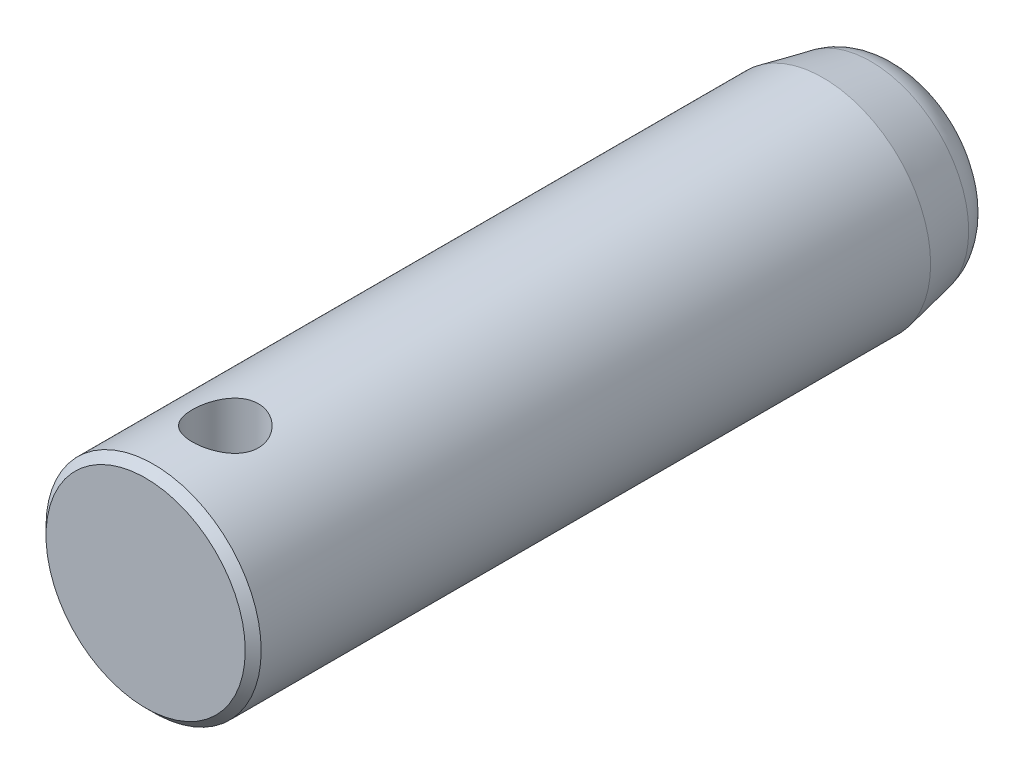
ISO-10303-21;
HEADER;
FILE_DESCRIPTION(('STEP AP214'),'2;1');
FILE_NAME('part.step','',(''),(''),'','','');
FILE_SCHEMA(('AUTOMOTIVE_DESIGN { 1 0 10303 214 1 1 1 1 }'));
ENDSEC;
DATA;
#1=APPLICATION_CONTEXT('core data for automotive mechanical design processes');
#2=APPLICATION_PROTOCOL_DEFINITION('international standard','automotive_design',2000,#1);
#3=PRODUCT_CONTEXT('',#1,'mechanical');
#4=PRODUCT('Part','Part','',(#3));
#5=PRODUCT_RELATED_PRODUCT_CATEGORY('part','',(#4));
#6=PRODUCT_DEFINITION_FORMATION('','',#4);
#7=PRODUCT_DEFINITION_CONTEXT('part definition',#1,'design');
#8=PRODUCT_DEFINITION('design','',#6,#7);
#9=PRODUCT_DEFINITION_SHAPE('','',#8);
#10=(LENGTH_UNIT() NAMED_UNIT(*) SI_UNIT(.MILLI.,.METRE.));
#11=(NAMED_UNIT(*) PLANE_ANGLE_UNIT() SI_UNIT($,.RADIAN.));
#12=(NAMED_UNIT(*) SI_UNIT($,.STERADIAN.) SOLID_ANGLE_UNIT());
#13=UNCERTAINTY_MEASURE_WITH_UNIT(LENGTH_MEASURE(1.E-05),#10,'distance_accuracy_value','');
#14=(GEOMETRIC_REPRESENTATION_CONTEXT(3) GLOBAL_UNCERTAINTY_ASSIGNED_CONTEXT((#13)) GLOBAL_UNIT_ASSIGNED_CONTEXT((#10,
#11,#12)) REPRESENTATION_CONTEXT('',''));
#15=CARTESIAN_POINT('',(0.,0.,0.));
#16=DIRECTION('',(0.,0.,1.));
#17=DIRECTION('',(1.,0.,0.));
#18=AXIS2_PLACEMENT_3D('',#15,#16,#17);
#19=CARTESIAN_POINT('',(0.,0.,-95.));
#20=DIRECTION('',(0.,0.,1.));
#21=DIRECTION('',(1.,0.,0.));
#22=AXIS2_PLACEMENT_3D('',#19,#20,#21);
#23=PLANE('',#22);
#24=CARTESIAN_POINT('',(0.,0.,-95.));
#25=DIRECTION('',(0.,0.,1.));
#26=DIRECTION('',(1.,0.,0.));
#27=AXIS2_PLACEMENT_3D('',#24,#25,#26);
#28=CIRCLE('',#27,7.38030565633467);
#29=CARTESIAN_POINT('',(7.38030565633467,0.,-95.));
#30=VERTEX_POINT('',#29);
#31=EDGE_CURVE('E10',#30,#30,#28,.T.);
#32=ORIENTED_EDGE('',*,*,#31,.F.);
#33=EDGE_LOOP('',(#32));
#34=FACE_BOUND('',#33,.T.);
#35=ADVANCED_FACE('F32',(#34),#23,.F.);
#36=CARTESIAN_POINT('',(0.,0.,-90.));
#37=DIRECTION('',(0.,0.,1.));
#38=DIRECTION('',(1.,0.,0.));
#39=AXIS2_PLACEMENT_3D('',#36,#37,#38);
#40=TOROIDAL_SURFACE('',#39,7.3803056563347,5.);
#41=CARTESIAN_POINT('',(0.,0.,-90.996839672086));
#42=DIRECTION('',(0.,0.,1.));
#43=DIRECTION('',(1.,0.,0.));
#44=AXIS2_PLACEMENT_3D('',#41,#42,#43);
#45=CIRCLE('',#44,12.2799291794389);
#46=CARTESIAN_POINT('',(12.2799291794389,0.,-90.996839672086));
#47=VERTEX_POINT('',#46);
#48=EDGE_CURVE('E38',#47,#47,#45,.T.);
#49=ORIENTED_EDGE('',*,*,#48,.F.);
#50=EDGE_LOOP('',(#49));
#51=FACE_BOUND('',#50,.T.);
#52=ORIENTED_EDGE('',*,*,#31,.T.);
#53=EDGE_LOOP('',(#52));
#54=FACE_BOUND('',#53,.T.);
#55=ADVANCED_FACE('F86',(#51,#54),#40,.T.);
#56=CARTESIAN_POINT('',(0.,0.,-90.996839672086));
#57=DIRECTION('',(0.,0.,1.));
#58=DIRECTION('',(1.,0.,0.));
#59=AXIS2_PLACEMENT_3D('',#56,#57,#58);
#60=CONICAL_SURFACE('',#59,12.2799291794389,0.200712863979348);
#61=CARTESIAN_POINT('',(0.,0.,-85.));
#62=DIRECTION('',(0.,0.,1.));
#63=DIRECTION('',(1.,0.,0.));
#64=AXIS2_PLACEMENT_3D('',#61,#62,#63);
#65=CIRCLE('',#64,13.5);
#66=CARTESIAN_POINT('',(13.5,0.,-85.));
#67=VERTEX_POINT('',#66);
#68=EDGE_CURVE('E42',#67,#67,#65,.T.);
#69=ORIENTED_EDGE('',*,*,#68,.F.);
#70=EDGE_LOOP('',(#69));
#71=FACE_BOUND('',#70,.T.);
#72=ORIENTED_EDGE('',*,*,#48,.T.);
#73=EDGE_LOOP('',(#72));
#74=FACE_BOUND('',#73,.T.);
#75=ADVANCED_FACE('F83',(#71,#74),#60,.T.);
#76=CARTESIAN_POINT('',(0.,0.,0.));
#77=DIRECTION('',(0.,0.,1.));
#78=DIRECTION('',(1.,0.,0.));
#79=AXIS2_PLACEMENT_3D('',#76,#77,#78);
#80=CYLINDRICAL_SURFACE('',#79,13.5);
#81=CARTESIAN_POINT('',(0.,-13.5,-5.85));
#82=CARTESIAN_POINT('',(-0.227402156007267,-13.4999985114752,-5.85000202340181));
#83=CARTESIAN_POINT('',(-0.454824968339302,-13.4941997302581,-5.86875273926511));
#84=CARTESIAN_POINT('',(-0.903031316792985,-13.4716346966968,-5.94307125364936));
#85=CARTESIAN_POINT('',(-1.12381313931206,-13.4548656386125,-5.99864847090315));
#86=CARTESIAN_POINT('',(-1.55220891966356,-13.4121942288627,-6.14457699874578));
#87=CARTESIAN_POINT('',(-1.75984231361689,-13.3863057478862,-6.23487551705309));
#88=CARTESIAN_POINT('',(-2.15702093556029,-13.3280758153734,-6.44746213115252));
#89=CARTESIAN_POINT('',(-2.34656348766923,-13.2957334113942,-6.56975494935885));
#90=CARTESIAN_POINT('',(-2.70786538277092,-13.2269507421959,-6.84672125546268));
#91=CARTESIAN_POINT('',(-2.87900580260451,-13.1904233620054,-7.00218042183089));
#92=CARTESIAN_POINT('',(-3.19324322225717,-13.1178983594875,-7.33939296074517));
#93=CARTESIAN_POINT('',(-3.33633521178908,-13.0819008328682,-7.52115102099837));
#94=CARTESIAN_POINT('',(-3.59372900090108,-13.0135819629174,-7.91111002046801));
#95=CARTESIAN_POINT('',(-3.70726493005124,-12.9813684442808,-8.11983715068284));
#96=CARTESIAN_POINT('',(-3.89736840380634,-12.9255717824294,-8.55457239406956));
#97=CARTESIAN_POINT('',(-3.97394533010134,-12.9019864494003,-8.78057610485526));
#98=CARTESIAN_POINT('',(-4.08570588385705,-12.867026401145,-9.23647883648235));
#99=CARTESIAN_POINT('',(-4.12203473020294,-12.8553147095788,-9.46607056790324));
#100=CARTESIAN_POINT('',(-4.15584500674148,-12.8444266713359,-9.92836599565646));
#101=CARTESIAN_POINT('',(-4.15333638394895,-12.8452471149403,-10.1610688799085));
#102=CARTESIAN_POINT('',(-4.11044021260336,-12.8590327013092,-10.6135742797313));
#103=CARTESIAN_POINT('',(-4.07149974371518,-12.8715338595716,-10.8335304736431));
#104=CARTESIAN_POINT('',(-3.95918810327311,-12.9065198430853,-11.263623003534));
#105=CARTESIAN_POINT('',(-3.88581338030964,-12.9290056981048,-11.4737583241693));
#106=CARTESIAN_POINT('',(-3.70567612723075,-12.9817891067039,-11.8817293241424));
#107=CARTESIAN_POINT('',(-3.5984530779988,-13.0121933290453,-12.0793472718526));
#108=CARTESIAN_POINT('',(-3.35398276504338,-13.0773378249785,-12.4542645180682));
#109=CARTESIAN_POINT('',(-3.21672791543712,-13.1120791931579,-12.6315586656091));
#110=CARTESIAN_POINT('',(-2.90895386576823,-13.1838532734004,-12.968987565674));
#111=CARTESIAN_POINT('',(-2.73723745155003,-13.2209195702755,-13.1280251328282));
#112=CARTESIAN_POINT('',(-2.36911014946948,-13.2918172589167,-13.4153084348377));
#113=CARTESIAN_POINT('',(-2.17269754978059,-13.3256484261519,-13.5435520334012));
#114=CARTESIAN_POINT('',(-1.75868848152416,-13.3865998005739,-13.7663184515394));
#115=CARTESIAN_POINT('',(-1.54094724254517,-13.4136689807238,-13.8605871185585));
#116=CARTESIAN_POINT('',(-1.09167347800343,-13.457678365562,-14.0108363972219));
#117=CARTESIAN_POINT('',(-0.860145021006423,-13.4746215422742,-14.066828243966));
#118=CARTESIAN_POINT('',(-0.399188106412075,-13.4959950029713,-14.1370829400978));
#119=CARTESIAN_POINT('',(-0.170006448803978,-13.5008706668949,-14.1528317975624));
#120=CARTESIAN_POINT('',(0.287745416691617,-13.498872619694,-14.1463330724631));
#121=CARTESIAN_POINT('',(0.516315706166909,-13.4920005636251,-14.1240908422031));
#122=CARTESIAN_POINT('',(0.960675494497208,-13.4675714515657,-14.043437895994));
#123=CARTESIAN_POINT('',(1.17663991931202,-13.4502738512498,-13.9859048486332));
#124=CARTESIAN_POINT('',(1.59579566926548,-13.4070082324494,-13.8373681819906));
#125=CARTESIAN_POINT('',(1.79898542949823,-13.381039154152,-13.7463604713559));
#126=CARTESIAN_POINT('',(2.19221812267537,-13.3223373717104,-13.5310238449964));
#127=CARTESIAN_POINT('',(2.38183124869987,-13.2894579633788,-13.4059511280695));
#128=CARTESIAN_POINT('',(2.73787962413219,-13.220701610105,-13.1269318949357));
#129=CARTESIAN_POINT('',(2.90430876171323,-13.1848238787098,-12.9729777899448));
#130=CARTESIAN_POINT('',(3.21587033057996,-13.1123897918169,-12.6335792260664));
#131=CARTESIAN_POINT('',(3.35994433065731,-13.075859990711,-12.4471553110202));
#132=CARTESIAN_POINT('',(3.61485020488153,-13.0077026722783,-12.0519825161036));
#133=CARTESIAN_POINT('',(3.7256827585564,-12.9760750547466,-11.8432340927135));
#134=CARTESIAN_POINT('',(3.91023966396336,-12.9216601439022,-11.4098705696321));
#135=CARTESIAN_POINT('',(3.98412058305053,-12.8988356468056,-11.1853270931831));
#136=CARTESIAN_POINT('',(4.09277666601773,-12.8647768867868,-10.7261463855507));
#137=CARTESIAN_POINT('',(4.127566093726,-12.853538396449,-10.4915128685211));
#138=CARTESIAN_POINT('',(4.15604952644762,-12.8443547896536,-10.0298484534816));
#139=CARTESIAN_POINT('',(4.15147530687562,-12.8458494569784,-9.80293419356281));
#140=CARTESIAN_POINT('',(4.10552258575548,-12.8606085993591,-9.35327329552538));
#141=CARTESIAN_POINT('',(4.06414569867098,-12.8738725581183,-9.13052647502666));
#142=CARTESIAN_POINT('',(3.94690468087593,-12.9102906828205,-8.69851045070577));
#143=CARTESIAN_POINT('',(3.87152084296221,-12.9333068485791,-8.48909840021823));
#144=CARTESIAN_POINT('',(3.6887820730902,-12.9866047993612,-8.0857271769166));
#145=CARTESIAN_POINT('',(3.58142079187376,-13.0168880270587,-7.89177108265202));
#146=CARTESIAN_POINT('',(3.33299815357153,-13.0827447309675,-7.51683686550757));
#147=CARTESIAN_POINT('',(3.19081067615643,-13.1184755716584,-7.33663257207719));
#148=CARTESIAN_POINT('',(2.87877202274273,-13.1904614239745,-7.00208083647706));
#149=CARTESIAN_POINT('',(2.7089135407234,-13.2267165717234,-6.84774024503557));
#150=CARTESIAN_POINT('',(2.3399697344458,-13.2970238815157,-6.56448108276189));
#151=CARTESIAN_POINT('',(2.14013736722609,-13.3309718952768,-6.43650688508655));
#152=CARTESIAN_POINT('',(1.72075073501906,-13.3915568619035,-6.21614372184271));
#153=CARTESIAN_POINT('',(1.50120488448952,-13.4181969145775,-6.1237396618073));
#154=CARTESIAN_POINT('',(1.06991188305481,-13.4591133603792,-5.9845018162803));
#155=CARTESIAN_POINT('',(0.859366298679378,-13.4743153877928,-5.93420534725839));
#156=CARTESIAN_POINT('',(0.432552652041234,-13.4947584828185,-5.86695659896587));
#157=CARTESIAN_POINT('',(0.21628566908605,-13.5000014157587,-5.84999807551158));
#158=CARTESIAN_POINT('',(0.,-13.5,-5.85));
#159=B_SPLINE_CURVE_WITH_KNOTS('',3,(#81,#82,#83,#84,#85,#86,#87,#88,#89,#90,#91,#92,#93,#94,
#95,#96,#97,#98,#99,#100,#101,#102,#103,#104,#105,#106,#107,#108,#109,#110,#111,#112,#113,#114,
#115,#116,#117,#118,#119,#120,#121,#122,#123,#124,#125,#126,#127,#128,#129,#130,#131,#132,#133,
#134,#135,#136,#137,#138,#139,#140,#141,#142,#143,#144,#145,#146,#147,#148,#149,#150,#151,#152,
#153,#154,#155,#156,#157,#158),.UNSPECIFIED.,.T.,.F.,(4,2,2,2,2,2,2,2,2,2,2,2,2,2,2,2,2,2,2,2,2,
2,2,2,2,2,2,2,2,2,2,2,2,2,2,2,2,2,4),(0.,0.68141169044088,1.36299772579499,2.04355151003841,
2.72420580193038,3.42325233322634,4.1224236215387,4.83822754434267,5.55384967146526,
6.24854021504378,6.94305283810006,7.61109995028716,8.2792159772963,8.95684502644675,
9.63464543931846,10.3422469398867,11.0498975152189,11.7627369355173,12.4753670316182,
13.1612752230664,13.8470867895824,14.5164975718987,15.1859901983922,15.871470040127,
16.5571302493392,17.2690237307241,17.9809026584545,18.6897391832454,19.3983169814273,
20.0758863108633,20.7534259180761,21.4216822525062,22.0900713606422,22.7838735745449,
23.4778592719708,24.1935164223663,24.9088695423617,25.5570920478896,26.2051931300331),.UNSPECIFIED.);
#160=CARTESIAN_POINT('',(0.,-13.5,-5.85));
#161=VERTEX_POINT('',#160);
#162=EDGE_CURVE('E54',#161,#161,#159,.T.);
#163=ORIENTED_EDGE('',*,*,#162,.F.);
#164=EDGE_LOOP('',(#163));
#165=FACE_BOUND('',#164,.T.);
#166=CARTESIAN_POINT('',(0.,13.5,-5.85));
#167=CARTESIAN_POINT('',(0.227402156007267,13.4999985114752,-5.85000202340181));
#168=CARTESIAN_POINT('',(0.454824968339302,13.4941997302581,-5.86875273926511));
#169=CARTESIAN_POINT('',(0.903031316792985,13.4716346966968,-5.94307125364936));
#170=CARTESIAN_POINT('',(1.12381313931206,13.4548656386125,-5.99864847090315));
#171=CARTESIAN_POINT('',(1.55220891966356,13.4121942288627,-6.14457699874578));
#172=CARTESIAN_POINT('',(1.75984231361689,13.3863057478862,-6.23487551705309));
#173=CARTESIAN_POINT('',(2.15702093556029,13.3280758153734,-6.44746213115252));
#174=CARTESIAN_POINT('',(2.34656348766923,13.2957334113942,-6.56975494935885));
#175=CARTESIAN_POINT('',(2.70786538277092,13.2269507421959,-6.84672125546268));
#176=CARTESIAN_POINT('',(2.87900580260451,13.1904233620054,-7.00218042183089));
#177=CARTESIAN_POINT('',(3.19324322225717,13.1178983594875,-7.33939296074517));
#178=CARTESIAN_POINT('',(3.33633521178908,13.0819008328682,-7.52115102099837));
#179=CARTESIAN_POINT('',(3.59372900090108,13.0135819629174,-7.91111002046801));
#180=CARTESIAN_POINT('',(3.70726493005124,12.9813684442808,-8.11983715068284));
#181=CARTESIAN_POINT('',(3.89736840380634,12.9255717824294,-8.55457239406956));
#182=CARTESIAN_POINT('',(3.97394533010134,12.9019864494003,-8.78057610485526));
#183=CARTESIAN_POINT('',(4.08570588385705,12.867026401145,-9.23647883648235));
#184=CARTESIAN_POINT('',(4.12203473020294,12.8553147095788,-9.46607056790324));
#185=CARTESIAN_POINT('',(4.15584500674148,12.8444266713359,-9.92836599565646));
#186=CARTESIAN_POINT('',(4.15333638394895,12.8452471149403,-10.1610688799085));
#187=CARTESIAN_POINT('',(4.11044021260336,12.8590327013092,-10.6135742797313));
#188=CARTESIAN_POINT('',(4.07149974371518,12.8715338595716,-10.8335304736431));
#189=CARTESIAN_POINT('',(3.95918810327311,12.9065198430853,-11.263623003534));
#190=CARTESIAN_POINT('',(3.88581338030964,12.9290056981048,-11.4737583241693));
#191=CARTESIAN_POINT('',(3.70567612723075,12.9817891067039,-11.8817293241424));
#192=CARTESIAN_POINT('',(3.5984530779988,13.0121933290453,-12.0793472718526));
#193=CARTESIAN_POINT('',(3.35398276504338,13.0773378249785,-12.4542645180682));
#194=CARTESIAN_POINT('',(3.21672791543712,13.1120791931579,-12.6315586656091));
#195=CARTESIAN_POINT('',(2.90895386576823,13.1838532734004,-12.968987565674));
#196=CARTESIAN_POINT('',(2.73723745155003,13.2209195702755,-13.1280251328282));
#197=CARTESIAN_POINT('',(2.36911014946948,13.2918172589167,-13.4153084348377));
#198=CARTESIAN_POINT('',(2.17269754978059,13.3256484261519,-13.5435520334012));
#199=CARTESIAN_POINT('',(1.75868848152416,13.3865998005739,-13.7663184515394));
#200=CARTESIAN_POINT('',(1.54094724254517,13.4136689807238,-13.8605871185585));
#201=CARTESIAN_POINT('',(1.09167347800343,13.457678365562,-14.0108363972219));
#202=CARTESIAN_POINT('',(0.860145021006423,13.4746215422742,-14.066828243966));
#203=CARTESIAN_POINT('',(0.399188106412075,13.4959950029713,-14.1370829400978));
#204=CARTESIAN_POINT('',(0.170006448803978,13.5008706668949,-14.1528317975624));
#205=CARTESIAN_POINT('',(-0.287745416691617,13.498872619694,-14.1463330724631));
#206=CARTESIAN_POINT('',(-0.516315706166909,13.4920005636251,-14.1240908422031));
#207=CARTESIAN_POINT('',(-0.960675494497208,13.4675714515657,-14.043437895994));
#208=CARTESIAN_POINT('',(-1.17663991931202,13.4502738512498,-13.9859048486332));
#209=CARTESIAN_POINT('',(-1.59579566926548,13.4070082324494,-13.8373681819906));
#210=CARTESIAN_POINT('',(-1.79898542949823,13.381039154152,-13.7463604713559));
#211=CARTESIAN_POINT('',(-2.19221812267537,13.3223373717104,-13.5310238449964));
#212=CARTESIAN_POINT('',(-2.38183124869987,13.2894579633788,-13.4059511280695));
#213=CARTESIAN_POINT('',(-2.73787962413219,13.220701610105,-13.1269318949357));
#214=CARTESIAN_POINT('',(-2.90430876171323,13.1848238787098,-12.9729777899448));
#215=CARTESIAN_POINT('',(-3.21587033057996,13.1123897918169,-12.6335792260664));
#216=CARTESIAN_POINT('',(-3.35994433065731,13.075859990711,-12.4471553110202));
#217=CARTESIAN_POINT('',(-3.61485020488153,13.0077026722783,-12.0519825161036));
#218=CARTESIAN_POINT('',(-3.7256827585564,12.9760750547466,-11.8432340927135));
#219=CARTESIAN_POINT('',(-3.91023966396336,12.9216601439022,-11.4098705696321));
#220=CARTESIAN_POINT('',(-3.98412058305053,12.8988356468056,-11.1853270931831));
#221=CARTESIAN_POINT('',(-4.09277666601773,12.8647768867868,-10.7261463855507));
#222=CARTESIAN_POINT('',(-4.127566093726,12.853538396449,-10.4915128685211));
#223=CARTESIAN_POINT('',(-4.15604952644762,12.8443547896536,-10.0298484534816));
#224=CARTESIAN_POINT('',(-4.15147530687562,12.8458494569784,-9.80293419356281));
#225=CARTESIAN_POINT('',(-4.10552258575548,12.8606085993591,-9.35327329552538));
#226=CARTESIAN_POINT('',(-4.06414569867098,12.8738725581183,-9.13052647502666));
#227=CARTESIAN_POINT('',(-3.94690468087593,12.9102906828205,-8.69851045070577));
#228=CARTESIAN_POINT('',(-3.87152084296221,12.9333068485791,-8.48909840021823));
#229=CARTESIAN_POINT('',(-3.6887820730902,12.9866047993612,-8.0857271769166));
#230=CARTESIAN_POINT('',(-3.58142079187376,13.0168880270587,-7.89177108265202));
#231=CARTESIAN_POINT('',(-3.33299815357153,13.0827447309675,-7.51683686550757));
#232=CARTESIAN_POINT('',(-3.19081067615643,13.1184755716584,-7.33663257207719));
#233=CARTESIAN_POINT('',(-2.87877202274273,13.1904614239745,-7.00208083647706));
#234=CARTESIAN_POINT('',(-2.7089135407234,13.2267165717234,-6.84774024503557));
#235=CARTESIAN_POINT('',(-2.3399697344458,13.2970238815157,-6.56448108276189));
#236=CARTESIAN_POINT('',(-2.14013736722609,13.3309718952768,-6.43650688508655));
#237=CARTESIAN_POINT('',(-1.72075073501906,13.3915568619035,-6.21614372184271));
#238=CARTESIAN_POINT('',(-1.50120488448952,13.4181969145775,-6.1237396618073));
#239=CARTESIAN_POINT('',(-1.06991188305481,13.4591133603792,-5.9845018162803));
#240=CARTESIAN_POINT('',(-0.859366298679378,13.4743153877928,-5.93420534725839));
#241=CARTESIAN_POINT('',(-0.432552652041234,13.4947584828185,-5.86695659896587));
#242=CARTESIAN_POINT('',(-0.21628566908605,13.5000014157587,-5.84999807551158));
#243=CARTESIAN_POINT('',(0.,13.5,-5.85));
#244=B_SPLINE_CURVE_WITH_KNOTS('',3,(#166,#167,#168,#169,#170,#171,#172,#173,#174,#175,#176,
#177,#178,#179,#180,#181,#182,#183,#184,#185,#186,#187,#188,#189,#190,#191,#192,#193,#194,#195,
#196,#197,#198,#199,#200,#201,#202,#203,#204,#205,#206,#207,#208,#209,#210,#211,#212,#213,#214,
#215,#216,#217,#218,#219,#220,#221,#222,#223,#224,#225,#226,#227,#228,#229,#230,#231,#232,#233,
#234,#235,#236,#237,#238,#239,#240,#241,#242,#243),.UNSPECIFIED.,.T.,.F.,(4,2,2,2,2,2,2,2,2,2,2,
2,2,2,2,2,2,2,2,2,2,2,2,2,2,2,2,2,2,2,2,2,2,2,2,2,2,2,4),(0.,0.68141169044088,1.36299772579499,
2.04355151003841,2.72420580193038,3.42325233322634,4.1224236215387,4.83822754434267,
5.55384967146526,6.24854021504378,6.94305283810006,7.61109995028716,8.2792159772963,
8.95684502644675,9.63464543931846,10.3422469398867,11.0498975152189,11.7627369355173,
12.4753670316182,13.1612752230664,13.8470867895824,14.5164975718987,15.1859901983922,
15.871470040127,16.5571302493392,17.2690237307241,17.9809026584545,18.6897391832454,
19.3983169814273,20.0758863108633,20.7534259180761,21.4216822525062,22.0900713606422,
22.7838735745449,23.4778592719708,24.1935164223663,24.9088695423617,25.5570920478896,
26.2051931300331),.UNSPECIFIED.);
#245=CARTESIAN_POINT('',(0.,13.5,-5.85));
#246=VERTEX_POINT('',#245);
#247=EDGE_CURVE('E61',#246,#246,#244,.T.);
#248=ORIENTED_EDGE('',*,*,#247,.F.);
#249=EDGE_LOOP('',(#248));
#250=FACE_BOUND('',#249,.T.);
#251=CARTESIAN_POINT('',(0.,0.,-1.));
#252=DIRECTION('',(0.,0.,1.));
#253=DIRECTION('',(1.,0.,0.));
#254=AXIS2_PLACEMENT_3D('',#251,#252,#253);
#255=CIRCLE('',#254,13.5);
#256=CARTESIAN_POINT('',(13.5,0.,-1.));
#257=VERTEX_POINT('',#256);
#258=EDGE_CURVE('E46',#257,#257,#255,.T.);
#259=ORIENTED_EDGE('',*,*,#258,.F.);
#260=EDGE_LOOP('',(#259));
#261=FACE_BOUND('',#260,.T.);
#262=ORIENTED_EDGE('',*,*,#68,.T.);
#263=EDGE_LOOP('',(#262));
#264=FACE_BOUND('',#263,.T.);
#265=ADVANCED_FACE('F79',(#165,#250,#261,#264),#80,.T.);
#266=CARTESIAN_POINT('',(0.,0.,-1.));
#267=DIRECTION('',(0.,0.,-1.));
#268=DIRECTION('',(-1.,0.,0.));
#269=AXIS2_PLACEMENT_3D('',#266,#267,#268);
#270=CONICAL_SURFACE('',#269,13.5,0.785398163397448);
#271=CARTESIAN_POINT('',(0.,0.,0.));
#272=DIRECTION('',(0.,0.,1.));
#273=DIRECTION('',(1.,0.,0.));
#274=AXIS2_PLACEMENT_3D('',#271,#272,#273);
#275=CIRCLE('',#274,12.5);
#276=CARTESIAN_POINT('',(12.5,0.,0.));
#277=VERTEX_POINT('',#276);
#278=EDGE_CURVE('E51',#277,#277,#275,.T.);
#279=ORIENTED_EDGE('',*,*,#278,.F.);
#280=EDGE_LOOP('',(#279));
#281=FACE_BOUND('',#280,.T.);
#282=ORIENTED_EDGE('',*,*,#258,.T.);
#283=EDGE_LOOP('',(#282));
#284=FACE_BOUND('',#283,.T.);
#285=ADVANCED_FACE('F75',(#281,#284),#270,.T.);
#286=CARTESIAN_POINT('',(0.,12.5,0.));
#287=DIRECTION('',(0.,0.,-1.));
#288=DIRECTION('',(-1.,0.,0.));
#289=AXIS2_PLACEMENT_3D('',#286,#287,#288);
#290=PLANE('',#289);
#291=ORIENTED_EDGE('',*,*,#278,.T.);
#292=EDGE_LOOP('',(#291));
#293=FACE_BOUND('',#292,.T.);
#294=ADVANCED_FACE('F70',(#293),#290,.F.);
#295=CARTESIAN_POINT('',(0.,-13.501,-10.));
#296=DIRECTION('',(0.,1.,0.));
#297=DIRECTION('',(0.,0.,1.));
#298=AXIS2_PLACEMENT_3D('',#295,#296,#297);
#299=CYLINDRICAL_SURFACE('',#298,4.15);
#300=ORIENTED_EDGE('',*,*,#162,.T.);
#301=EDGE_LOOP('',(#300));
#302=FACE_BOUND('',#301,.T.);
#303=ORIENTED_EDGE('',*,*,#247,.T.);
#304=EDGE_LOOP('',(#303));
#305=FACE_BOUND('',#304,.T.);
#306=ADVANCED_FACE('F64',(#302,#305),#299,.F.);
#307=CLOSED_SHELL('',(#35,#55,#75,#265,#285,#294,#306));
#308=MANIFOLD_SOLID_BREP('B2',#307);
#309=ADVANCED_BREP_SHAPE_REPRESENTATION('',(#18,#308),#14);
#310=SHAPE_DEFINITION_REPRESENTATION(#9,#309);
ENDSEC;
END-ISO-10303-21;
